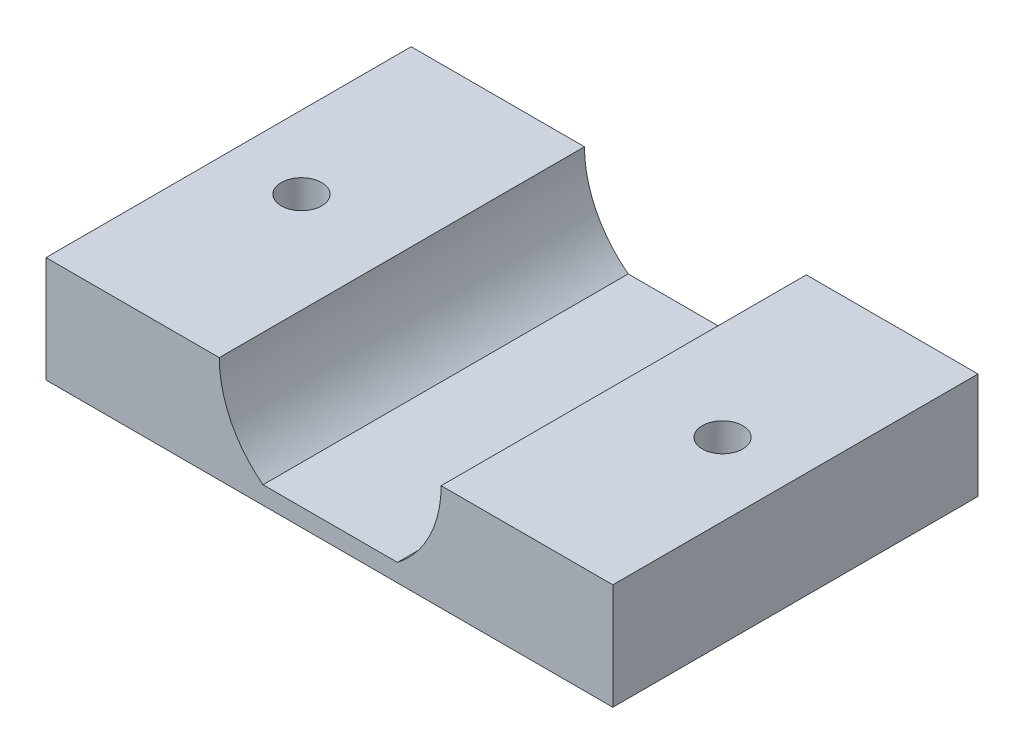
ISO-10303-21;
HEADER;
FILE_DESCRIPTION(('STEP AP214'),'2;1');
FILE_NAME('part.step','',(''),(''),'','','');
FILE_SCHEMA(('AUTOMOTIVE_DESIGN { 1 0 10303 214 1 1 1 1 }'));
ENDSEC;
DATA;
#1=APPLICATION_CONTEXT('core data for automotive mechanical design processes');
#2=APPLICATION_PROTOCOL_DEFINITION('international standard','automotive_design',2000,#1);
#3=PRODUCT_CONTEXT('',#1,'mechanical');
#4=PRODUCT('Part','Part','',(#3));
#5=PRODUCT_RELATED_PRODUCT_CATEGORY('part','',(#4));
#6=PRODUCT_DEFINITION_FORMATION('','',#4);
#7=PRODUCT_DEFINITION_CONTEXT('part definition',#1,'design');
#8=PRODUCT_DEFINITION('design','',#6,#7);
#9=PRODUCT_DEFINITION_SHAPE('','',#8);
#10=(LENGTH_UNIT() NAMED_UNIT(*) SI_UNIT(.MILLI.,.METRE.));
#11=(NAMED_UNIT(*) PLANE_ANGLE_UNIT() SI_UNIT($,.RADIAN.));
#12=(NAMED_UNIT(*) SI_UNIT($,.STERADIAN.) SOLID_ANGLE_UNIT());
#13=UNCERTAINTY_MEASURE_WITH_UNIT(LENGTH_MEASURE(1.E-05),#10,'distance_accuracy_value','');
#14=(GEOMETRIC_REPRESENTATION_CONTEXT(3) GLOBAL_UNCERTAINTY_ASSIGNED_CONTEXT((#13)) GLOBAL_UNIT_ASSIGNED_CONTEXT((#10,
#11,#12)) REPRESENTATION_CONTEXT('',''));
#15=CARTESIAN_POINT('',(0.,0.,0.));
#16=DIRECTION('',(0.,0.,1.));
#17=DIRECTION('',(1.,0.,0.));
#18=AXIS2_PLACEMENT_3D('',#15,#16,#17);
#19=CARTESIAN_POINT('',(0.,0.,0.));
#20=DIRECTION('',(0.,0.,1.));
#21=DIRECTION('',(1.,0.,0.));
#22=AXIS2_PLACEMENT_3D('',#19,#20,#21);
#23=PLANE('',#22);
#24=DIRECTION('',(0.,1.,0.));
#25=VECTOR('',#24,1.);
#26=CARTESIAN_POINT('',(17.5,0.,0.));
#27=LINE('',#26,#25);
#28=CARTESIAN_POINT('',(17.5,6.27500000000189,0.));
#29=VERTEX_POINT('',#28);
#30=CARTESIAN_POINT('',(17.5,12.8250000000009,0.));
#31=VERTEX_POINT('',#30);
#32=EDGE_CURVE('E105',#29,#31,#27,.T.);
#33=ORIENTED_EDGE('',*,*,#32,.F.);
#34=DIRECTION('',(-1.,0.,0.));
#35=VECTOR('',#34,1.);
#36=CARTESIAN_POINT('',(0.,6.27500000000189,0.));
#37=LINE('',#36,#35);
#38=CARTESIAN_POINT('',(-17.5,6.27500000000189,0.));
#39=VERTEX_POINT('',#38);
#40=EDGE_CURVE('E118',#29,#39,#37,.T.);
#41=ORIENTED_EDGE('',*,*,#40,.T.);
#42=DIRECTION('',(0.,1.,0.));
#43=VECTOR('',#42,1.);
#44=CARTESIAN_POINT('',(-17.5,0.,0.));
#45=LINE('',#44,#43);
#46=CARTESIAN_POINT('',(-17.5,12.8250000000009,0.));
#47=VERTEX_POINT('',#46);
#48=EDGE_CURVE('E64',#39,#47,#45,.T.);
#49=ORIENTED_EDGE('',*,*,#48,.T.);
#50=DIRECTION('',(1.,0.,0.));
#51=VECTOR('',#50,1.);
#52=CARTESIAN_POINT('',(0.,12.8250000000009,0.));
#53=LINE('',#52,#51);
#54=CARTESIAN_POINT('',(-6.80000000000091,12.8250000000009,0.));
#55=VERTEX_POINT('',#54);
#56=EDGE_CURVE('E178',#47,#55,#53,.T.);
#57=ORIENTED_EDGE('',*,*,#56,.T.);
#58=CARTESIAN_POINT('',(0.0499999999990855,12.8250000000009,0.));
#59=DIRECTION('',(0.,0.,-1.));
#60=DIRECTION('',(-1.,0.,0.));
#61=AXIS2_PLACEMENT_3D('',#58,#59,#60);
#62=CIRCLE('',#61,6.85);
#63=CARTESIAN_POINT('',(-4.0996987842502,7.37500000000092,0.));
#64=VERTEX_POINT('',#63);
#65=EDGE_CURVE('E138',#64,#55,#62,.T.);
#66=ORIENTED_EDGE('',*,*,#65,.F.);
#67=DIRECTION('',(-1.,0.,0.));
#68=VECTOR('',#67,1.);
#69=CARTESIAN_POINT('',(0.,7.37500000000092,0.));
#70=LINE('',#69,#68);
#71=CARTESIAN_POINT('',(4.19969878424837,7.37500000000092,0.));
#72=VERTEX_POINT('',#71);
#73=EDGE_CURVE('E130',#72,#64,#70,.T.);
#74=ORIENTED_EDGE('',*,*,#73,.F.);
#75=CARTESIAN_POINT('',(0.0499999999990855,12.8250000000009,0.));
#76=DIRECTION('',(0.,0.,-1.));
#77=DIRECTION('',(-1.,0.,0.));
#78=AXIS2_PLACEMENT_3D('',#75,#76,#77);
#79=CIRCLE('',#78,6.85);
#80=CARTESIAN_POINT('',(6.89999999999908,12.8250000000009,0.));
#81=VERTEX_POINT('',#80);
#82=EDGE_CURVE('E142',#81,#72,#79,.T.);
#83=ORIENTED_EDGE('',*,*,#82,.F.);
#84=EDGE_CURVE('E113',#81,#31,#53,.T.);
#85=ORIENTED_EDGE('',*,*,#84,.T.);
#86=EDGE_LOOP('',(#33,#41,#49,#57,#66,#74,#83,#85));
#87=FACE_BOUND('',#86,.T.);
#88=ADVANCED_FACE('F39',(#87),#23,.F.);
#89=CARTESIAN_POINT('',(0.,0.,22.55));
#90=DIRECTION('',(0.,0.,1.));
#91=DIRECTION('',(1.,0.,0.));
#92=AXIS2_PLACEMENT_3D('',#89,#90,#91);
#93=PLANE('',#92);
#94=DIRECTION('',(1.,0.,0.));
#95=VECTOR('',#94,1.);
#96=CARTESIAN_POINT('',(0.,6.27500000000189,22.55));
#97=LINE('',#96,#95);
#98=CARTESIAN_POINT('',(-17.5,6.27500000000189,22.55));
#99=VERTEX_POINT('',#98);
#100=CARTESIAN_POINT('',(17.5,6.27500000000189,22.55));
#101=VERTEX_POINT('',#100);
#102=EDGE_CURVE('E125',#99,#101,#97,.T.);
#103=ORIENTED_EDGE('',*,*,#102,.T.);
#104=DIRECTION('',(0.,1.,0.));
#105=VECTOR('',#104,1.);
#106=CARTESIAN_POINT('',(17.5,0.,22.55));
#107=LINE('',#106,#105);
#108=CARTESIAN_POINT('',(17.5,12.8250000000009,22.55));
#109=VERTEX_POINT('',#108);
#110=EDGE_CURVE('E56',#101,#109,#107,.T.);
#111=ORIENTED_EDGE('',*,*,#110,.T.);
#112=DIRECTION('',(1.,0.,0.));
#113=VECTOR('',#112,1.);
#114=CARTESIAN_POINT('',(0.,12.8250000000009,22.55));
#115=LINE('',#114,#113);
#116=CARTESIAN_POINT('',(6.89999999999908,12.8250000000009,22.55));
#117=VERTEX_POINT('',#116);
#118=EDGE_CURVE('E121',#117,#109,#115,.T.);
#119=ORIENTED_EDGE('',*,*,#118,.F.);
#120=CARTESIAN_POINT('',(0.0499999999990855,12.8250000000009,22.55));
#121=DIRECTION('',(0.,0.,1.));
#122=DIRECTION('',(1.,0.,0.));
#123=AXIS2_PLACEMENT_3D('',#120,#121,#122);
#124=CIRCLE('',#123,6.85);
#125=CARTESIAN_POINT('',(4.19969878424837,7.37500000000092,22.55));
#126=VERTEX_POINT('',#125);
#127=EDGE_CURVE('E48',#126,#117,#124,.T.);
#128=ORIENTED_EDGE('',*,*,#127,.F.);
#129=DIRECTION('',(1.,0.,0.));
#130=VECTOR('',#129,1.);
#131=CARTESIAN_POINT('',(0.,7.37500000000092,22.55));
#132=LINE('',#131,#130);
#133=CARTESIAN_POINT('',(-4.0996987842502,7.37500000000092,22.55));
#134=VERTEX_POINT('',#133);
#135=EDGE_CURVE('E11',#134,#126,#132,.T.);
#136=ORIENTED_EDGE('',*,*,#135,.F.);
#137=CARTESIAN_POINT('',(0.0499999999990855,12.8250000000009,22.55));
#138=DIRECTION('',(0.,0.,1.));
#139=DIRECTION('',(1.,0.,0.));
#140=AXIS2_PLACEMENT_3D('',#137,#138,#139);
#141=CIRCLE('',#140,6.85);
#142=CARTESIAN_POINT('',(-6.80000000000091,12.8250000000009,22.55));
#143=VERTEX_POINT('',#142);
#144=EDGE_CURVE('E150',#143,#134,#141,.T.);
#145=ORIENTED_EDGE('',*,*,#144,.F.);
#146=CARTESIAN_POINT('',(-17.5,12.8250000000009,22.55));
#147=VERTEX_POINT('',#146);
#148=EDGE_CURVE('E188',#147,#143,#115,.T.);
#149=ORIENTED_EDGE('',*,*,#148,.F.);
#150=DIRECTION('',(0.,1.,0.));
#151=VECTOR('',#150,1.);
#152=CARTESIAN_POINT('',(-17.5,0.,22.55));
#153=LINE('',#152,#151);
#154=EDGE_CURVE('E184',#99,#147,#153,.T.);
#155=ORIENTED_EDGE('',*,*,#154,.F.);
#156=EDGE_LOOP('',(#103,#111,#119,#128,#136,#145,#149,#155));
#157=FACE_BOUND('',#156,.T.);
#158=ADVANCED_FACE('F204',(#157),#93,.T.);
#159=CARTESIAN_POINT('',(0.,6.27500000000189,63.));
#160=DIRECTION('',(0.,-1.,0.));
#161=DIRECTION('',(1.,0.,0.));
#162=AXIS2_PLACEMENT_3D('',#159,#160,#161);
#163=PLANE('',#162);
#164=CARTESIAN_POINT('',(13.,6.27500000000189,11.275));
#165=DIRECTION('',(0.,-1.,0.));
#166=DIRECTION('',(1.,0.,0.));
#167=AXIS2_PLACEMENT_3D('',#164,#165,#166);
#168=CIRCLE('',#167,1.25);
#169=CARTESIAN_POINT('',(14.25,6.27500000000189,11.275));
#170=VERTEX_POINT('',#169);
#171=EDGE_CURVE('E161',#170,#170,#168,.T.);
#172=ORIENTED_EDGE('',*,*,#171,.F.);
#173=EDGE_LOOP('',(#172));
#174=FACE_BOUND('',#173,.T.);
#175=CARTESIAN_POINT('',(-13.,6.27500000000189,11.275));
#176=DIRECTION('',(0.,-1.,0.));
#177=DIRECTION('',(-1.,0.,0.));
#178=AXIS2_PLACEMENT_3D('',#175,#176,#177);
#179=CIRCLE('',#178,1.25);
#180=CARTESIAN_POINT('',(-14.25,6.27500000000189,11.275));
#181=VERTEX_POINT('',#180);
#182=EDGE_CURVE('E168',#181,#181,#179,.T.);
#183=ORIENTED_EDGE('',*,*,#182,.F.);
#184=EDGE_LOOP('',(#183));
#185=FACE_BOUND('',#184,.T.);
#186=ORIENTED_EDGE('',*,*,#40,.F.);
#187=DIRECTION('',(0.,0.,1.));
#188=VECTOR('',#187,1.);
#189=CARTESIAN_POINT('',(17.5,6.27500000000189,0.));
#190=LINE('',#189,#188);
#191=EDGE_CURVE('E102',#29,#101,#190,.T.);
#192=ORIENTED_EDGE('',*,*,#191,.T.);
#193=ORIENTED_EDGE('',*,*,#102,.F.);
#194=DIRECTION('',(0.,0.,1.));
#195=VECTOR('',#194,1.);
#196=CARTESIAN_POINT('',(-17.5,6.27500000000189,0.));
#197=LINE('',#196,#195);
#198=EDGE_CURVE('E112',#39,#99,#197,.T.);
#199=ORIENTED_EDGE('',*,*,#198,.F.);
#200=EDGE_LOOP('',(#186,#192,#193,#199));
#201=FACE_BOUND('',#200,.T.);
#202=ADVANCED_FACE('F123',(#174,#185,#201),#163,.T.);
#203=CARTESIAN_POINT('',(0.0499999999990855,12.8250000000009,63.));
#204=DIRECTION('',(0.,0.,-1.));
#205=DIRECTION('',(-1.,0.,0.));
#206=AXIS2_PLACEMENT_3D('',#203,#204,#205);
#207=CYLINDRICAL_SURFACE('',#206,6.85);
#208=ORIENTED_EDGE('',*,*,#127,.T.);
#209=DIRECTION('',(0.,0.,1.));
#210=VECTOR('',#209,1.);
#211=CARTESIAN_POINT('',(6.89999999999908,12.8250000000009,0.));
#212=LINE('',#211,#210);
#213=EDGE_CURVE('E132',#81,#117,#212,.T.);
#214=ORIENTED_EDGE('',*,*,#213,.F.);
#215=ORIENTED_EDGE('',*,*,#82,.T.);
#216=DIRECTION('',(0.,0.,-1.));
#217=VECTOR('',#216,1.);
#218=CARTESIAN_POINT('',(4.19969878424837,7.37500000000092,63.));
#219=LINE('',#218,#217);
#220=EDGE_CURVE('E146',#126,#72,#219,.T.);
#221=ORIENTED_EDGE('',*,*,#220,.F.);
#222=EDGE_LOOP('',(#208,#214,#215,#221));
#223=FACE_BOUND('',#222,.T.);
#224=ADVANCED_FACE('F220',(#223),#207,.F.);
#225=CARTESIAN_POINT('',(0.,7.37500000000092,63.));
#226=DIRECTION('',(0.,-1.,0.));
#227=DIRECTION('',(0.,0.,-1.));
#228=AXIS2_PLACEMENT_3D('',#225,#226,#227);
#229=PLANE('',#228);
#230=ORIENTED_EDGE('',*,*,#135,.T.);
#231=ORIENTED_EDGE('',*,*,#220,.T.);
#232=ORIENTED_EDGE('',*,*,#73,.T.);
#233=DIRECTION('',(0.,0.,-1.));
#234=VECTOR('',#233,1.);
#235=CARTESIAN_POINT('',(-4.0996987842502,7.37500000000092,63.));
#236=LINE('',#235,#234);
#237=EDGE_CURVE('E145',#134,#64,#236,.T.);
#238=ORIENTED_EDGE('',*,*,#237,.F.);
#239=EDGE_LOOP('',(#230,#231,#232,#238));
#240=FACE_BOUND('',#239,.T.);
#241=ADVANCED_FACE('F216',(#240),#229,.F.);
#242=CARTESIAN_POINT('',(0.0499999999990855,12.8250000000009,63.));
#243=DIRECTION('',(0.,0.,-1.));
#244=DIRECTION('',(-1.,0.,0.));
#245=AXIS2_PLACEMENT_3D('',#242,#243,#244);
#246=CYLINDRICAL_SURFACE('',#245,6.85);
#247=ORIENTED_EDGE('',*,*,#65,.T.);
#248=DIRECTION('',(0.,0.,1.));
#249=VECTOR('',#248,1.);
#250=CARTESIAN_POINT('',(-6.80000000000091,12.8250000000009,0.));
#251=LINE('',#250,#249);
#252=EDGE_CURVE('E193',#55,#143,#251,.T.);
#253=ORIENTED_EDGE('',*,*,#252,.T.);
#254=ORIENTED_EDGE('',*,*,#144,.T.);
#255=ORIENTED_EDGE('',*,*,#237,.T.);
#256=EDGE_LOOP('',(#247,#253,#254,#255));
#257=FACE_BOUND('',#256,.T.);
#258=ADVANCED_FACE('F211',(#257),#246,.F.);
#259=CARTESIAN_POINT('',(-17.5,0.,0.));
#260=DIRECTION('',(1.,0.,0.));
#261=DIRECTION('',(0.,0.,-1.));
#262=AXIS2_PLACEMENT_3D('',#259,#260,#261);
#263=PLANE('',#262);
#264=ORIENTED_EDGE('',*,*,#154,.T.);
#265=DIRECTION('',(0.,0.,1.));
#266=VECTOR('',#265,1.);
#267=CARTESIAN_POINT('',(-17.5,12.8250000000009,0.));
#268=LINE('',#267,#266);
#269=EDGE_CURVE('E197',#47,#147,#268,.T.);
#270=ORIENTED_EDGE('',*,*,#269,.F.);
#271=ORIENTED_EDGE('',*,*,#48,.F.);
#272=ORIENTED_EDGE('',*,*,#198,.T.);
#273=EDGE_LOOP('',(#264,#270,#271,#272));
#274=FACE_BOUND('',#273,.T.);
#275=ADVANCED_FACE('F201',(#274),#263,.F.);
#276=CARTESIAN_POINT('',(0.,12.8250000000009,0.));
#277=DIRECTION('',(0.,-1.,0.));
#278=DIRECTION('',(0.,0.,-1.));
#279=AXIS2_PLACEMENT_3D('',#276,#277,#278);
#280=PLANE('',#279);
#281=CARTESIAN_POINT('',(-13.,12.8250000000009,11.275));
#282=DIRECTION('',(0.,-1.,0.));
#283=DIRECTION('',(0.,0.,-1.));
#284=AXIS2_PLACEMENT_3D('',#281,#282,#283);
#285=CIRCLE('',#284,1.25);
#286=CARTESIAN_POINT('',(-13.,12.8250000000009,10.025));
#287=VERTEX_POINT('',#286);
#288=EDGE_CURVE('E42',#287,#287,#285,.T.);
#289=ORIENTED_EDGE('',*,*,#288,.T.);
#290=EDGE_LOOP('',(#289));
#291=FACE_BOUND('',#290,.T.);
#292=ORIENTED_EDGE('',*,*,#148,.T.);
#293=ORIENTED_EDGE('',*,*,#252,.F.);
#294=ORIENTED_EDGE('',*,*,#56,.F.);
#295=ORIENTED_EDGE('',*,*,#269,.T.);
#296=EDGE_LOOP('',(#292,#293,#294,#295));
#297=FACE_BOUND('',#296,.T.);
#298=ADVANCED_FACE('F208',(#291,#297),#280,.F.);
#299=CARTESIAN_POINT('',(17.5,0.,0.));
#300=DIRECTION('',(1.,0.,0.));
#301=DIRECTION('',(0.,0.,-1.));
#302=AXIS2_PLACEMENT_3D('',#299,#300,#301);
#303=PLANE('',#302);
#304=ORIENTED_EDGE('',*,*,#110,.F.);
#305=ORIENTED_EDGE('',*,*,#191,.F.);
#306=ORIENTED_EDGE('',*,*,#32,.T.);
#307=DIRECTION('',(0.,0.,1.));
#308=VECTOR('',#307,1.);
#309=CARTESIAN_POINT('',(17.5,12.8250000000009,0.));
#310=LINE('',#309,#308);
#311=EDGE_CURVE('E126',#31,#109,#310,.T.);
#312=ORIENTED_EDGE('',*,*,#311,.T.);
#313=EDGE_LOOP('',(#304,#305,#306,#312));
#314=FACE_BOUND('',#313,.T.);
#315=ADVANCED_FACE('F104',(#314),#303,.T.);
#316=CARTESIAN_POINT('',(13.,12.8250000000009,11.275));
#317=DIRECTION('',(0.,-1.,0.));
#318=DIRECTION('',(0.,0.,-1.));
#319=AXIS2_PLACEMENT_3D('',#316,#317,#318);
#320=CIRCLE('',#319,1.25);
#321=CARTESIAN_POINT('',(13.,12.8250000000009,10.025));
#322=VERTEX_POINT('',#321);
#323=EDGE_CURVE('E158',#322,#322,#320,.T.);
#324=ORIENTED_EDGE('',*,*,#323,.T.);
#325=EDGE_LOOP('',(#324));
#326=FACE_BOUND('',#325,.T.);
#327=ORIENTED_EDGE('',*,*,#118,.T.);
#328=ORIENTED_EDGE('',*,*,#311,.F.);
#329=ORIENTED_EDGE('',*,*,#84,.F.);
#330=ORIENTED_EDGE('',*,*,#213,.T.);
#331=EDGE_LOOP('',(#327,#328,#329,#330));
#332=FACE_BOUND('',#331,.T.);
#333=ADVANCED_FACE('F227',(#326,#332),#280,.F.);
#334=CARTESIAN_POINT('',(13.,16.2750000000019,11.275));
#335=DIRECTION('',(0.,-1.,0.));
#336=DIRECTION('',(1.,0.,0.));
#337=AXIS2_PLACEMENT_3D('',#334,#335,#336);
#338=CYLINDRICAL_SURFACE('',#337,1.25);
#339=ORIENTED_EDGE('',*,*,#171,.T.);
#340=EDGE_LOOP('',(#339));
#341=FACE_BOUND('',#340,.T.);
#342=ORIENTED_EDGE('',*,*,#323,.F.);
#343=EDGE_LOOP('',(#342));
#344=FACE_BOUND('',#343,.T.);
#345=ADVANCED_FACE('F229',(#341,#344),#338,.F.);
#346=CARTESIAN_POINT('',(-13.,16.2750000000019,11.275));
#347=DIRECTION('',(0.,-1.,0.));
#348=DIRECTION('',(1.,0.,0.));
#349=AXIS2_PLACEMENT_3D('',#346,#347,#348);
#350=CYLINDRICAL_SURFACE('',#349,1.25);
#351=ORIENTED_EDGE('',*,*,#182,.T.);
#352=EDGE_LOOP('',(#351));
#353=FACE_BOUND('',#352,.T.);
#354=ORIENTED_EDGE('',*,*,#288,.F.);
#355=EDGE_LOOP('',(#354));
#356=FACE_BOUND('',#355,.T.);
#357=ADVANCED_FACE('F235',(#353,#356),#350,.F.);
#358=CLOSED_SHELL('',(#88,#158,#202,#224,#241,#258,#275,#298,#315,#333,#345,#357));
#359=MANIFOLD_SOLID_BREP('B2',#358);
#360=ADVANCED_BREP_SHAPE_REPRESENTATION('',(#18,#359),#14);
#361=SHAPE_DEFINITION_REPRESENTATION(#9,#360);
ENDSEC;
END-ISO-10303-21;
